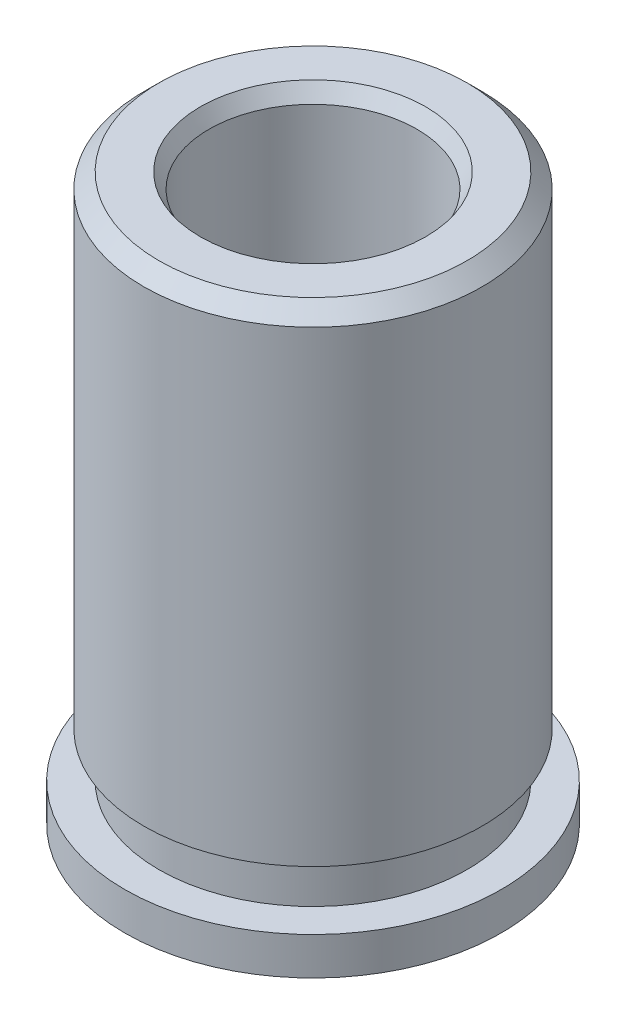
ISO-10303-21;
HEADER;
FILE_DESCRIPTION(('STEP AP214'),'2;1');
FILE_NAME('part.step','',(''),(''),'','','');
FILE_SCHEMA(('AUTOMOTIVE_DESIGN { 1 0 10303 214 1 1 1 1 }'));
ENDSEC;
DATA;
#1=APPLICATION_CONTEXT('core data for automotive mechanical design processes');
#2=APPLICATION_PROTOCOL_DEFINITION('international standard','automotive_design',2000,#1);
#3=PRODUCT_CONTEXT('',#1,'mechanical');
#4=PRODUCT('Part','Part','',(#3));
#5=PRODUCT_RELATED_PRODUCT_CATEGORY('part','',(#4));
#6=PRODUCT_DEFINITION_FORMATION('','',#4);
#7=PRODUCT_DEFINITION_CONTEXT('part definition',#1,'design');
#8=PRODUCT_DEFINITION('design','',#6,#7);
#9=PRODUCT_DEFINITION_SHAPE('','',#8);
#10=(LENGTH_UNIT() NAMED_UNIT(*) SI_UNIT(.MILLI.,.METRE.));
#11=(NAMED_UNIT(*) PLANE_ANGLE_UNIT() SI_UNIT($,.RADIAN.));
#12=(NAMED_UNIT(*) SI_UNIT($,.STERADIAN.) SOLID_ANGLE_UNIT());
#13=UNCERTAINTY_MEASURE_WITH_UNIT(LENGTH_MEASURE(1.E-05),#10,'distance_accuracy_value','');
#14=(GEOMETRIC_REPRESENTATION_CONTEXT(3) GLOBAL_UNCERTAINTY_ASSIGNED_CONTEXT((#13)) GLOBAL_UNIT_ASSIGNED_CONTEXT((#10,
#11,#12)) REPRESENTATION_CONTEXT('',''));
#15=CARTESIAN_POINT('',(0.,0.,0.));
#16=DIRECTION('',(0.,0.,1.));
#17=DIRECTION('',(1.,0.,0.));
#18=AXIS2_PLACEMENT_3D('',#15,#16,#17);
#19=CARTESIAN_POINT('',(0.,4.7625,0.));
#20=DIRECTION('',(0.,1.,0.));
#21=DIRECTION('',(0.,0.,1.));
#22=AXIS2_PLACEMENT_3D('',#19,#20,#21);
#23=CYLINDRICAL_SURFACE('',#22,3.175);
#24=CARTESIAN_POINT('',(0.,-4.7625,0.));
#25=DIRECTION('',(0.,1.,0.));
#26=DIRECTION('',(0.,0.,1.));
#27=AXIS2_PLACEMENT_3D('',#24,#25,#26);
#28=CIRCLE('',#27,3.175);
#29=CARTESIAN_POINT('',(0.,-4.7625,3.175));
#30=VERTEX_POINT('',#29);
#31=EDGE_CURVE('E51',#30,#30,#28,.T.);
#32=ORIENTED_EDGE('',*,*,#31,.T.);
#33=EDGE_LOOP('',(#32));
#34=FACE_BOUND('',#33,.T.);
#35=CARTESIAN_POINT('',(0.,-4.1275,0.));
#36=DIRECTION('',(0.,1.,0.));
#37=DIRECTION('',(0.,0.,1.));
#38=AXIS2_PLACEMENT_3D('',#35,#36,#37);
#39=CIRCLE('',#38,3.175);
#40=CARTESIAN_POINT('',(0.,-4.1275,3.175));
#41=VERTEX_POINT('',#40);
#42=EDGE_CURVE('E9',#41,#41,#39,.T.);
#43=ORIENTED_EDGE('',*,*,#42,.F.);
#44=EDGE_LOOP('',(#43));
#45=FACE_BOUND('',#44,.T.);
#46=ADVANCED_FACE('F14',(#34,#45),#23,.T.);
#47=CARTESIAN_POINT('',(1.5875,-4.1275,0.));
#48=DIRECTION('',(0.,1.,0.));
#49=DIRECTION('',(0.,0.,1.));
#50=AXIS2_PLACEMENT_3D('',#47,#48,#49);
#51=PLANE('',#50);
#52=ORIENTED_EDGE('',*,*,#42,.T.);
#53=EDGE_LOOP('',(#52));
#54=FACE_BOUND('',#53,.T.);
#55=CARTESIAN_POINT('',(0.,-4.1275,0.));
#56=DIRECTION('',(0.,1.,0.));
#57=DIRECTION('',(0.,0.,1.));
#58=AXIS2_PLACEMENT_3D('',#55,#56,#57);
#59=CIRCLE('',#58,2.59715);
#60=CARTESIAN_POINT('',(0.,-4.1275,2.59715));
#61=VERTEX_POINT('',#60);
#62=EDGE_CURVE('E20',#61,#61,#59,.T.);
#63=ORIENTED_EDGE('',*,*,#62,.F.);
#64=EDGE_LOOP('',(#63));
#65=FACE_BOUND('',#64,.T.);
#66=ADVANCED_FACE('F77',(#54,#65),#51,.T.);
#67=CARTESIAN_POINT('',(0.,4.7625,0.));
#68=DIRECTION('',(0.,1.,0.));
#69=DIRECTION('',(0.,0.,1.));
#70=AXIS2_PLACEMENT_3D('',#67,#68,#69);
#71=CYLINDRICAL_SURFACE('',#70,2.59715);
#72=ORIENTED_EDGE('',*,*,#62,.T.);
#73=EDGE_LOOP('',(#72));
#74=FACE_BOUND('',#73,.T.);
#75=CARTESIAN_POINT('',(0.,-3.3655,0.));
#76=DIRECTION('',(0.,1.,0.));
#77=DIRECTION('',(0.,0.,1.));
#78=AXIS2_PLACEMENT_3D('',#75,#76,#77);
#79=CIRCLE('',#78,2.59715);
#80=CARTESIAN_POINT('',(0.,-3.3655,2.59715));
#81=VERTEX_POINT('',#80);
#82=EDGE_CURVE('E24',#81,#81,#79,.T.);
#83=ORIENTED_EDGE('',*,*,#82,.F.);
#84=EDGE_LOOP('',(#83));
#85=FACE_BOUND('',#84,.T.);
#86=ADVANCED_FACE('F82',(#74,#85),#71,.T.);
#87=CARTESIAN_POINT('',(1.5875,-3.3655,0.));
#88=DIRECTION('',(0.,-1.,0.));
#89=DIRECTION('',(0.,0.,-1.));
#90=AXIS2_PLACEMENT_3D('',#87,#88,#89);
#91=PLANE('',#90);
#92=ORIENTED_EDGE('',*,*,#82,.T.);
#93=EDGE_LOOP('',(#92));
#94=FACE_BOUND('',#93,.T.);
#95=CARTESIAN_POINT('',(0.,-3.3655,0.));
#96=DIRECTION('',(0.,1.,0.));
#97=DIRECTION('',(0.,0.,1.));
#98=AXIS2_PLACEMENT_3D('',#95,#96,#97);
#99=CIRCLE('',#98,2.85115);
#100=CARTESIAN_POINT('',(0.,-3.3655,2.85115));
#101=VERTEX_POINT('',#100);
#102=EDGE_CURVE('E28',#101,#101,#99,.T.);
#103=ORIENTED_EDGE('',*,*,#102,.F.);
#104=EDGE_LOOP('',(#103));
#105=FACE_BOUND('',#104,.T.);
#106=ADVANCED_FACE('F87',(#94,#105),#91,.T.);
#107=CARTESIAN_POINT('',(0.,4.7625,0.));
#108=DIRECTION('',(0.,1.,0.));
#109=DIRECTION('',(0.,0.,1.));
#110=AXIS2_PLACEMENT_3D('',#107,#108,#109);
#111=CYLINDRICAL_SURFACE('',#110,2.85115);
#112=ORIENTED_EDGE('',*,*,#102,.T.);
#113=EDGE_LOOP('',(#112));
#114=FACE_BOUND('',#113,.T.);
#115=CARTESIAN_POINT('',(0.,4.5085,0.));
#116=DIRECTION('',(0.,1.,0.));
#117=DIRECTION('',(0.,0.,1.));
#118=AXIS2_PLACEMENT_3D('',#115,#116,#117);
#119=CIRCLE('',#118,2.85115);
#120=CARTESIAN_POINT('',(0.,4.5085,2.85115));
#121=VERTEX_POINT('',#120);
#122=EDGE_CURVE('E33',#121,#121,#119,.T.);
#123=ORIENTED_EDGE('',*,*,#122,.F.);
#124=EDGE_LOOP('',(#123));
#125=FACE_BOUND('',#124,.T.);
#126=ADVANCED_FACE('F93',(#114,#125),#111,.T.);
#127=CARTESIAN_POINT('',(0.,4.7625,0.));
#128=DIRECTION('',(0.,-1.,0.));
#129=DIRECTION('',(0.,0.,-1.));
#130=AXIS2_PLACEMENT_3D('',#127,#128,#129);
#131=CONICAL_SURFACE('',#130,2.59715,0.785398163397449);
#132=ORIENTED_EDGE('',*,*,#122,.T.);
#133=EDGE_LOOP('',(#132));
#134=FACE_BOUND('',#133,.T.);
#135=CARTESIAN_POINT('',(0.,4.7625,0.));
#136=DIRECTION('',(0.,1.,0.));
#137=DIRECTION('',(0.,0.,1.));
#138=AXIS2_PLACEMENT_3D('',#135,#136,#137);
#139=CIRCLE('',#138,2.59715);
#140=CARTESIAN_POINT('',(0.,4.7625,2.59715));
#141=VERTEX_POINT('',#140);
#142=EDGE_CURVE('E36',#141,#141,#139,.T.);
#143=ORIENTED_EDGE('',*,*,#142,.F.);
#144=EDGE_LOOP('',(#143));
#145=FACE_BOUND('',#144,.T.);
#146=ADVANCED_FACE('F97',(#134,#145),#131,.T.);
#147=CARTESIAN_POINT('',(1.58750000000002,4.7625,0.));
#148=DIRECTION('',(0.,1.,0.));
#149=DIRECTION('',(0.,0.,1.));
#150=AXIS2_PLACEMENT_3D('',#147,#148,#149);
#151=PLANE('',#150);
#152=ORIENTED_EDGE('',*,*,#142,.T.);
#153=EDGE_LOOP('',(#152));
#154=FACE_BOUND('',#153,.T.);
#155=CARTESIAN_POINT('',(0.,4.7625,0.));
#156=DIRECTION('',(0.,1.,0.));
#157=DIRECTION('',(0.,0.,1.));
#158=AXIS2_PLACEMENT_3D('',#155,#156,#157);
#159=CIRCLE('',#158,1.89924696837416);
#160=CARTESIAN_POINT('',(0.,4.7625,1.89924696837416));
#161=VERTEX_POINT('',#160);
#162=EDGE_CURVE('E39',#161,#161,#159,.T.);
#163=ORIENTED_EDGE('',*,*,#162,.F.);
#164=EDGE_LOOP('',(#163));
#165=FACE_BOUND('',#164,.T.);
#166=ADVANCED_FACE('F101',(#154,#165),#151,.T.);
#167=CARTESIAN_POINT('',(0.,4.5085,0.));
#168=DIRECTION('',(0.,1.,0.));
#169=DIRECTION('',(0.,0.,1.));
#170=AXIS2_PLACEMENT_3D('',#167,#168,#169);
#171=CONICAL_SURFACE('',#170,1.7526,0.523598775598297);
#172=ORIENTED_EDGE('',*,*,#162,.T.);
#173=EDGE_LOOP('',(#172));
#174=FACE_BOUND('',#173,.T.);
#175=CARTESIAN_POINT('',(0.,4.5085,0.));
#176=DIRECTION('',(0.,1.,0.));
#177=DIRECTION('',(0.,0.,1.));
#178=AXIS2_PLACEMENT_3D('',#175,#176,#177);
#179=CIRCLE('',#178,1.7526);
#180=CARTESIAN_POINT('',(0.,4.5085,1.7526));
#181=VERTEX_POINT('',#180);
#182=EDGE_CURVE('E42',#181,#181,#179,.T.);
#183=ORIENTED_EDGE('',*,*,#182,.F.);
#184=EDGE_LOOP('',(#183));
#185=FACE_BOUND('',#184,.T.);
#186=ADVANCED_FACE('F73',(#174,#185),#171,.F.);
#187=CARTESIAN_POINT('',(0.,4.7625,0.));
#188=DIRECTION('',(0.,1.,0.));
#189=DIRECTION('',(0.,0.,1.));
#190=AXIS2_PLACEMENT_3D('',#187,#188,#189);
#191=CYLINDRICAL_SURFACE('',#190,1.7526);
#192=ORIENTED_EDGE('',*,*,#182,.T.);
#193=EDGE_LOOP('',(#192));
#194=FACE_BOUND('',#193,.T.);
#195=CARTESIAN_POINT('',(0.,-4.5085,0.));
#196=DIRECTION('',(0.,1.,0.));
#197=DIRECTION('',(0.,0.,1.));
#198=AXIS2_PLACEMENT_3D('',#195,#196,#197);
#199=CIRCLE('',#198,1.7526);
#200=CARTESIAN_POINT('',(0.,-4.5085,1.7526));
#201=VERTEX_POINT('',#200);
#202=EDGE_CURVE('E45',#201,#201,#199,.T.);
#203=ORIENTED_EDGE('',*,*,#202,.F.);
#204=EDGE_LOOP('',(#203));
#205=FACE_BOUND('',#204,.T.);
#206=ADVANCED_FACE('F65',(#194,#205),#191,.F.);
#207=CARTESIAN_POINT('',(0.,-4.7625,0.));
#208=DIRECTION('',(0.,-1.,0.));
#209=DIRECTION('',(0.,0.,-1.));
#210=AXIS2_PLACEMENT_3D('',#207,#208,#209);
#211=CONICAL_SURFACE('',#210,1.89924696837417,0.523598775598301);
#212=ORIENTED_EDGE('',*,*,#202,.T.);
#213=EDGE_LOOP('',(#212));
#214=FACE_BOUND('',#213,.T.);
#215=CARTESIAN_POINT('',(0.,-4.7625,0.));
#216=DIRECTION('',(0.,1.,0.));
#217=DIRECTION('',(0.,0.,1.));
#218=AXIS2_PLACEMENT_3D('',#215,#216,#217);
#219=CIRCLE('',#218,1.89924696837417);
#220=CARTESIAN_POINT('',(0.,-4.7625,1.89924696837417));
#221=VERTEX_POINT('',#220);
#222=EDGE_CURVE('E48',#221,#221,#219,.T.);
#223=ORIENTED_EDGE('',*,*,#222,.F.);
#224=EDGE_LOOP('',(#223));
#225=FACE_BOUND('',#224,.T.);
#226=ADVANCED_FACE('F60',(#214,#225),#211,.F.);
#227=CARTESIAN_POINT('',(1.5875,-4.7625,0.));
#228=DIRECTION('',(0.,1.,0.));
#229=DIRECTION('',(0.,0.,1.));
#230=AXIS2_PLACEMENT_3D('',#227,#228,#229);
#231=PLANE('',#230);
#232=ORIENTED_EDGE('',*,*,#31,.F.);
#233=EDGE_LOOP('',(#232));
#234=FACE_BOUND('',#233,.T.);
#235=ORIENTED_EDGE('',*,*,#222,.T.);
#236=EDGE_LOOP('',(#235));
#237=FACE_BOUND('',#236,.T.);
#238=ADVANCED_FACE('F57',(#234,#237),#231,.F.);
#239=CLOSED_SHELL('',(#46,#66,#86,#106,#126,#146,#166,#186,#206,#226,#238));
#240=MANIFOLD_SOLID_BREP('B1',#239);
#241=ADVANCED_BREP_SHAPE_REPRESENTATION('',(#18,#240),#14);
#242=SHAPE_DEFINITION_REPRESENTATION(#9,#241);
ENDSEC;
END-ISO-10303-21;
